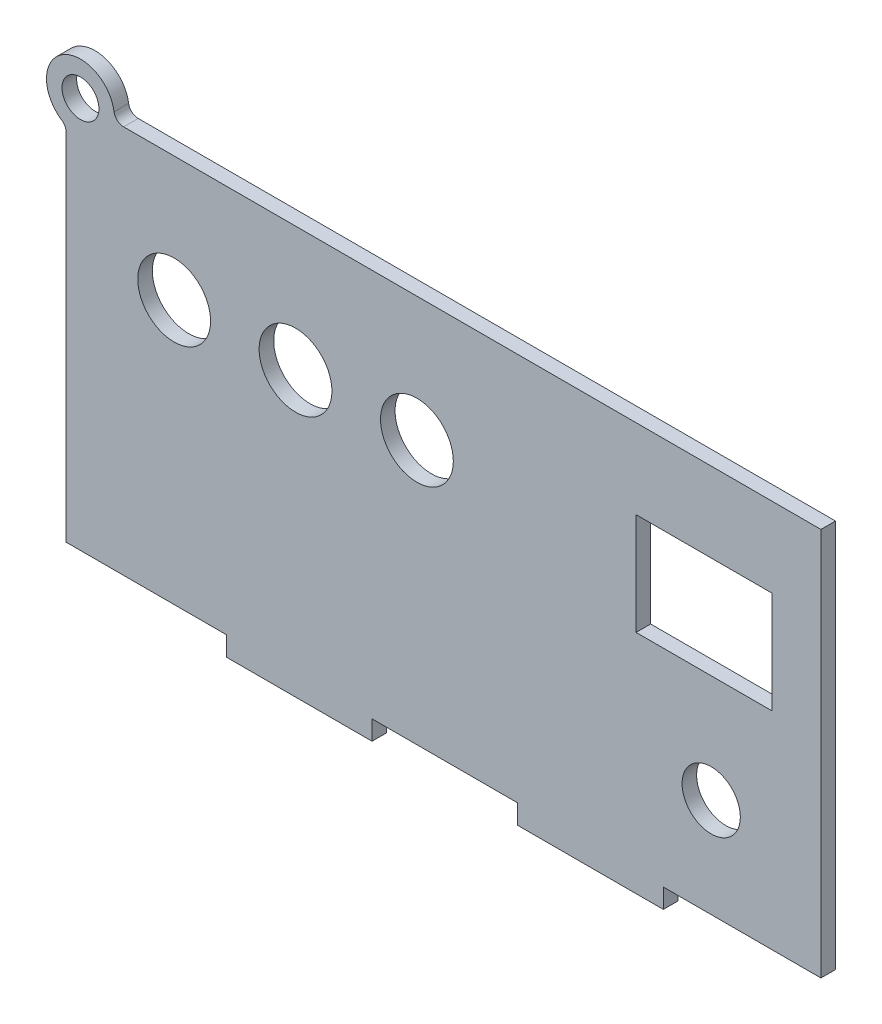
ISO-10303-21;
HEADER;
FILE_DESCRIPTION(('STEP AP214'),'2;1');
FILE_NAME('part.step','',(''),(''),'','','');
FILE_SCHEMA(('AUTOMOTIVE_DESIGN { 1 0 10303 214 1 1 1 1 }'));
ENDSEC;
DATA;
#1=APPLICATION_CONTEXT('core data for automotive mechanical design processes');
#2=APPLICATION_PROTOCOL_DEFINITION('international standard','automotive_design',2000,#1);
#3=PRODUCT_CONTEXT('',#1,'mechanical');
#4=PRODUCT('Part','Part','',(#3));
#5=PRODUCT_RELATED_PRODUCT_CATEGORY('part','',(#4));
#6=PRODUCT_DEFINITION_FORMATION('','',#4);
#7=PRODUCT_DEFINITION_CONTEXT('part definition',#1,'design');
#8=PRODUCT_DEFINITION('design','',#6,#7);
#9=PRODUCT_DEFINITION_SHAPE('','',#8);
#10=(LENGTH_UNIT() NAMED_UNIT(*) SI_UNIT(.MILLI.,.METRE.));
#11=(NAMED_UNIT(*) PLANE_ANGLE_UNIT() SI_UNIT($,.RADIAN.));
#12=(NAMED_UNIT(*) SI_UNIT($,.STERADIAN.) SOLID_ANGLE_UNIT());
#13=UNCERTAINTY_MEASURE_WITH_UNIT(LENGTH_MEASURE(1.E-05),#10,'distance_accuracy_value','');
#14=(GEOMETRIC_REPRESENTATION_CONTEXT(3) GLOBAL_UNCERTAINTY_ASSIGNED_CONTEXT((#13)) GLOBAL_UNIT_ASSIGNED_CONTEXT((#10,
#11,#12)) REPRESENTATION_CONTEXT('',''));
#15=CARTESIAN_POINT('',(0.,0.,0.));
#16=DIRECTION('',(0.,0.,1.));
#17=DIRECTION('',(1.,0.,0.));
#18=AXIS2_PLACEMENT_3D('',#15,#16,#17);
#19=CARTESIAN_POINT('',(-66.0593604878528,44.1837523820721,3.));
#20=DIRECTION('',(0.,0.,1.));
#21=DIRECTION('',(1.,0.,0.));
#22=AXIS2_PLACEMENT_3D('',#19,#20,#21);
#23=PLANE('',#22);
#24=CARTESIAN_POINT('',(-5.6639470731949,16.4892628720456,3.));
#25=DIRECTION('',(0.,0.,1.));
#26=DIRECTION('',(1.,0.,0.));
#27=AXIS2_PLACEMENT_3D('',#24,#25,#26);
#28=CIRCLE('',#27,7.5);
#29=CARTESIAN_POINT('',(1.8360529268051,16.4892628720456,3.));
#30=VERTEX_POINT('',#29);
#31=EDGE_CURVE('E623',#30,#30,#28,.T.);
#32=ORIENTED_EDGE('',*,*,#31,.F.);
#33=EDGE_LOOP('',(#32));
#34=FACE_BOUND('',#33,.T.);
#35=CARTESIAN_POINT('',(-55.6639470731949,16.4892628720456,3.));
#36=DIRECTION('',(0.,0.,1.));
#37=DIRECTION('',(1.,0.,0.));
#38=AXIS2_PLACEMENT_3D('',#35,#36,#37);
#39=CIRCLE('',#38,7.5);
#40=CARTESIAN_POINT('',(-48.1639470731949,16.4892628720456,3.));
#41=VERTEX_POINT('',#40);
#42=EDGE_CURVE('E192',#41,#41,#39,.T.);
#43=ORIENTED_EDGE('',*,*,#42,.F.);
#44=EDGE_LOOP('',(#43));
#45=FACE_BOUND('',#44,.T.);
#46=DIRECTION('',(-1.,0.,0.));
#47=VECTOR('',#46,1.);
#48=CARTESIAN_POINT('',(77.5537795455046,42.1837523820721,3.));
#49=LINE('',#48,#47);
#50=CARTESIAN_POINT('',(77.5537795455046,42.1837523820721,3.));
#51=VERTEX_POINT('',#50);
#52=CARTESIAN_POINT('',(-66.0593604878528,42.1837523820721,3.));
#53=VERTEX_POINT('',#52);
#54=EDGE_CURVE('E208',#51,#53,#49,.T.);
#55=ORIENTED_EDGE('',*,*,#54,.T.);
#56=CARTESIAN_POINT('',(-66.0593604878528,44.1837523820721,3.));
#57=DIRECTION('',(0.,0.,-1.));
#58=DIRECTION('',(1.,0.,0.));
#59=AXIS2_PLACEMENT_3D('',#56,#57,#58);
#60=CIRCLE('',#59,1.99999999999999);
#61=CARTESIAN_POINT('',(-68.0367324811814,43.883752382072,3.));
#62=VERTEX_POINT('',#61);
#63=EDGE_CURVE('E211',#53,#62,#60,.T.);
#64=ORIENTED_EDGE('',*,*,#63,.T.);
#65=CARTESIAN_POINT('',(-74.9575344578312,42.833752382072,3.));
#66=DIRECTION('',(0.,0.,1.));
#67=DIRECTION('',(1.,0.,0.));
#68=AXIS2_PLACEMENT_3D('',#65,#66,#67);
#69=CIRCLE('',#68,7.);
#70=CARTESIAN_POINT('',(-78.8075344578312,36.9875998011005,3.));
#71=VERTEX_POINT('',#70);
#72=EDGE_CURVE('E214',#62,#71,#69,.T.);
#73=ORIENTED_EDGE('',*,*,#72,.T.);
#74=CARTESIAN_POINT('',(-79.9075344578312,35.3172704922515,3.));
#75=DIRECTION('',(0.,0.,-1.));
#76=DIRECTION('',(-1.,0.,0.));
#77=AXIS2_PLACEMENT_3D('',#74,#75,#76);
#78=CIRCLE('',#77,2.);
#79=CARTESIAN_POINT('',(-77.9075344578312,35.3172704922515,3.));
#80=VERTEX_POINT('',#79);
#81=EDGE_CURVE('E216',#71,#80,#78,.T.);
#82=ORIENTED_EDGE('',*,*,#81,.T.);
#83=DIRECTION('',(0.,-1.,0.));
#84=VECTOR('',#83,1.);
#85=CARTESIAN_POINT('',(-77.9075344578312,-37.8310829635035,3.));
#86=LINE('',#85,#84);
#87=CARTESIAN_POINT('',(-77.9075344578312,-37.8310829635035,3.));
#88=VERTEX_POINT('',#87);
#89=EDGE_CURVE('E218',#80,#88,#86,.T.);
#90=ORIENTED_EDGE('',*,*,#89,.T.);
#91=DIRECTION('',(1.,0.,0.));
#92=VECTOR('',#91,1.);
#93=CARTESIAN_POINT('',(-77.9075344578312,-37.8310829635035,3.));
#94=LINE('',#93,#92);
#95=CARTESIAN_POINT('',(-44.9075344578312,-37.8310829635035,3.));
#96=VERTEX_POINT('',#95);
#97=EDGE_CURVE('E220',#88,#96,#94,.T.);
#98=ORIENTED_EDGE('',*,*,#97,.T.);
#99=DIRECTION('',(0.,-1.,0.));
#100=VECTOR('',#99,1.);
#101=CARTESIAN_POINT('',(-44.9075344578312,-41.8310829635035,3.));
#102=LINE('',#101,#100);
#103=CARTESIAN_POINT('',(-44.9075344578312,-41.8310829635035,3.));
#104=VERTEX_POINT('',#103);
#105=EDGE_CURVE('E222',#96,#104,#102,.T.);
#106=ORIENTED_EDGE('',*,*,#105,.T.);
#107=DIRECTION('',(1.,0.,0.));
#108=VECTOR('',#107,1.);
#109=CARTESIAN_POINT('',(-14.9075344578312,-41.8310829635035,3.));
#110=LINE('',#109,#108);
#111=CARTESIAN_POINT('',(-14.9075344578312,-41.8310829635035,3.));
#112=VERTEX_POINT('',#111);
#113=EDGE_CURVE('E224',#104,#112,#110,.T.);
#114=ORIENTED_EDGE('',*,*,#113,.T.);
#115=DIRECTION('',(0.,1.,0.));
#116=VECTOR('',#115,1.);
#117=CARTESIAN_POINT('',(-14.9075344578312,-41.8310829635035,3.));
#118=LINE('',#117,#116);
#119=CARTESIAN_POINT('',(-14.9075344578312,-37.8310829635035,3.));
#120=VERTEX_POINT('',#119);
#121=EDGE_CURVE('E226',#112,#120,#118,.T.);
#122=ORIENTED_EDGE('',*,*,#121,.T.);
#123=DIRECTION('',(1.,0.,0.));
#124=VECTOR('',#123,1.);
#125=CARTESIAN_POINT('',(-14.9075344578312,-37.8310829635035,3.));
#126=LINE('',#125,#124);
#127=CARTESIAN_POINT('',(15.0924655421688,-37.8310829635035,3.));
#128=VERTEX_POINT('',#127);
#129=EDGE_CURVE('E228',#120,#128,#126,.T.);
#130=ORIENTED_EDGE('',*,*,#129,.T.);
#131=DIRECTION('',(0.,-1.,0.));
#132=VECTOR('',#131,1.);
#133=CARTESIAN_POINT('',(15.0924655421688,-41.8310829635035,3.));
#134=LINE('',#133,#132);
#135=CARTESIAN_POINT('',(15.0924655421688,-41.8310829635035,3.));
#136=VERTEX_POINT('',#135);
#137=EDGE_CURVE('E230',#128,#136,#134,.T.);
#138=ORIENTED_EDGE('',*,*,#137,.T.);
#139=DIRECTION('',(1.,0.,0.));
#140=VECTOR('',#139,1.);
#141=CARTESIAN_POINT('',(45.0924655421688,-41.8310829635035,3.));
#142=LINE('',#141,#140);
#143=CARTESIAN_POINT('',(45.0924655421688,-41.8310829635035,3.));
#144=VERTEX_POINT('',#143);
#145=EDGE_CURVE('E232',#136,#144,#142,.T.);
#146=ORIENTED_EDGE('',*,*,#145,.T.);
#147=DIRECTION('',(0.,1.,0.));
#148=VECTOR('',#147,1.);
#149=CARTESIAN_POINT('',(45.0924655421688,-41.8310829635035,3.));
#150=LINE('',#149,#148);
#151=CARTESIAN_POINT('',(45.0924655421688,-37.8310829635035,3.));
#152=VERTEX_POINT('',#151);
#153=EDGE_CURVE('E234',#144,#152,#150,.T.);
#154=ORIENTED_EDGE('',*,*,#153,.T.);
#155=DIRECTION('',(1.,0.,0.));
#156=VECTOR('',#155,1.);
#157=CARTESIAN_POINT('',(45.0924655421688,-37.8310829635035,3.));
#158=LINE('',#157,#156);
#159=CARTESIAN_POINT('',(77.5537795455046,-37.8310829635035,3.));
#160=VERTEX_POINT('',#159);
#161=EDGE_CURVE('E236',#152,#160,#158,.T.);
#162=ORIENTED_EDGE('',*,*,#161,.T.);
#163=DIRECTION('',(0.,1.,0.));
#164=VECTOR('',#163,1.);
#165=CARTESIAN_POINT('',(77.5537795455046,-37.8310829635035,3.));
#166=LINE('',#165,#164);
#167=EDGE_CURVE('E238',#160,#51,#166,.T.);
#168=ORIENTED_EDGE('',*,*,#167,.T.);
#169=EDGE_LOOP('',(#55,#64,#73,#82,#90,#98,#106,#114,#122,#130,#138,#146,#154,#162,#168));
#170=FACE_BOUND('',#169,.T.);
#171=CARTESIAN_POINT('',(-74.9575344578312,42.833752382072,3.));
#172=DIRECTION('',(0.,0.,1.));
#173=DIRECTION('',(1.,0.,0.));
#174=AXIS2_PLACEMENT_3D('',#171,#172,#173);
#175=CIRCLE('',#174,3.8);
#176=CARTESIAN_POINT('',(-71.1575344578312,42.833752382072,3.));
#177=VERTEX_POINT('',#176);
#178=EDGE_CURVE('E202',#177,#177,#175,.T.);
#179=ORIENTED_EDGE('',*,*,#178,.F.);
#180=EDGE_LOOP('',(#179));
#181=FACE_BOUND('',#180,.T.);
#182=DIRECTION('',(1.,0.,0.));
#183=VECTOR('',#182,1.);
#184=CARTESIAN_POINT('',(67.4777739645771,4.77680387150185,3.));
#185=LINE('',#184,#183);
#186=CARTESIAN_POINT('',(39.4777739645771,4.77680387150185,3.));
#187=VERTEX_POINT('',#186);
#188=CARTESIAN_POINT('',(67.4777739645771,4.77680387150185,3.));
#189=VERTEX_POINT('',#188);
#190=EDGE_CURVE('E171',#187,#189,#185,.T.);
#191=ORIENTED_EDGE('',*,*,#190,.F.);
#192=DIRECTION('',(0.,-1.,0.));
#193=VECTOR('',#192,1.);
#194=CARTESIAN_POINT('',(39.4777739645771,4.77680387150185,3.));
#195=LINE('',#194,#193);
#196=CARTESIAN_POINT('',(39.4777739645771,25.7768038715019,3.));
#197=VERTEX_POINT('',#196);
#198=EDGE_CURVE('E163',#197,#187,#195,.T.);
#199=ORIENTED_EDGE('',*,*,#198,.F.);
#200=DIRECTION('',(-1.,0.,0.));
#201=VECTOR('',#200,1.);
#202=CARTESIAN_POINT('',(67.4777739645771,25.7768038715019,3.));
#203=LINE('',#202,#201);
#204=CARTESIAN_POINT('',(67.4777739645771,25.7768038715019,3.));
#205=VERTEX_POINT('',#204);
#206=EDGE_CURVE('E186',#205,#197,#203,.T.);
#207=ORIENTED_EDGE('',*,*,#206,.F.);
#208=DIRECTION('',(0.,1.,0.));
#209=VECTOR('',#208,1.);
#210=CARTESIAN_POINT('',(67.4777739645771,4.77680387150185,3.));
#211=LINE('',#210,#209);
#212=EDGE_CURVE('E184',#189,#205,#211,.T.);
#213=ORIENTED_EDGE('',*,*,#212,.F.);
#214=EDGE_LOOP('',(#191,#199,#207,#213));
#215=FACE_BOUND('',#214,.T.);
#216=CARTESIAN_POINT('',(-30.6639470731949,16.4892628720456,3.));
#217=DIRECTION('',(0.,0.,1.));
#218=DIRECTION('',(1.,0.,0.));
#219=AXIS2_PLACEMENT_3D('',#216,#217,#218);
#220=CIRCLE('',#219,7.5);
#221=CARTESIAN_POINT('',(-23.1639470731949,16.4892628720456,3.));
#222=VERTEX_POINT('',#221);
#223=EDGE_CURVE('E629',#222,#222,#220,.T.);
#224=ORIENTED_EDGE('',*,*,#223,.F.);
#225=EDGE_LOOP('',(#224));
#226=FACE_BOUND('',#225,.T.);
#227=CARTESIAN_POINT('',(54.9508765511538,-17.4407031301117,3.));
#228=DIRECTION('',(0.,0.,1.));
#229=DIRECTION('',(1.,0.,0.));
#230=AXIS2_PLACEMENT_3D('',#227,#228,#229);
#231=CIRCLE('',#230,6.);
#232=CARTESIAN_POINT('',(60.9508765511538,-17.4407031301117,3.));
#233=VERTEX_POINT('',#232);
#234=EDGE_CURVE('E614',#233,#233,#231,.T.);
#235=ORIENTED_EDGE('',*,*,#234,.F.);
#236=EDGE_LOOP('',(#235));
#237=FACE_BOUND('',#236,.T.);
#238=ADVANCED_FACE('F32',(#34,#45,#170,#181,#215,#226,#237),#23,.T.);
#239=CARTESIAN_POINT('',(-66.0593604878528,44.1837523820721,0.));
#240=DIRECTION('',(0.,0.,1.));
#241=DIRECTION('',(1.,0.,0.));
#242=AXIS2_PLACEMENT_3D('',#239,#240,#241);
#243=PLANE('',#242);
#244=CARTESIAN_POINT('',(-74.9575344578312,42.833752382072,0.));
#245=DIRECTION('',(0.,0.,1.));
#246=DIRECTION('',(1.,0.,0.));
#247=AXIS2_PLACEMENT_3D('',#244,#245,#246);
#248=CIRCLE('',#247,3.8);
#249=CARTESIAN_POINT('',(-71.1575344578312,42.833752382072,0.));
#250=VERTEX_POINT('',#249);
#251=EDGE_CURVE('E179',#250,#250,#248,.T.);
#252=ORIENTED_EDGE('',*,*,#251,.T.);
#253=EDGE_LOOP('',(#252));
#254=FACE_BOUND('',#253,.T.);
#255=DIRECTION('',(-1.,0.,0.));
#256=VECTOR('',#255,1.);
#257=CARTESIAN_POINT('',(77.5537795455046,42.1837523820721,0.));
#258=LINE('',#257,#256);
#259=CARTESIAN_POINT('',(77.5537795455046,42.1837523820721,0.));
#260=VERTEX_POINT('',#259);
#261=CARTESIAN_POINT('',(-66.0593604878528,42.1837523820721,0.));
#262=VERTEX_POINT('',#261);
#263=EDGE_CURVE('E205',#260,#262,#258,.T.);
#264=ORIENTED_EDGE('',*,*,#263,.F.);
#265=DIRECTION('',(0.,1.,0.));
#266=VECTOR('',#265,1.);
#267=CARTESIAN_POINT('',(77.5537795455046,-37.8310829635035,0.));
#268=LINE('',#267,#266);
#269=CARTESIAN_POINT('',(77.5537795455046,-37.8310829635035,0.));
#270=VERTEX_POINT('',#269);
#271=EDGE_CURVE('E212',#270,#260,#268,.T.);
#272=ORIENTED_EDGE('',*,*,#271,.F.);
#273=DIRECTION('',(1.,0.,0.));
#274=VECTOR('',#273,1.);
#275=CARTESIAN_POINT('',(45.0924655421688,-37.8310829635035,0.));
#276=LINE('',#275,#274);
#277=CARTESIAN_POINT('',(45.0924655421688,-37.8310829635035,0.));
#278=VERTEX_POINT('',#277);
#279=EDGE_CURVE('E268',#278,#270,#276,.T.);
#280=ORIENTED_EDGE('',*,*,#279,.F.);
#281=DIRECTION('',(0.,1.,0.));
#282=VECTOR('',#281,1.);
#283=CARTESIAN_POINT('',(45.0924655421688,-41.8310829635035,0.));
#284=LINE('',#283,#282);
#285=CARTESIAN_POINT('',(45.0924655421688,-41.8310829635035,0.));
#286=VERTEX_POINT('',#285);
#287=EDGE_CURVE('E266',#286,#278,#284,.T.);
#288=ORIENTED_EDGE('',*,*,#287,.F.);
#289=DIRECTION('',(1.,0.,0.));
#290=VECTOR('',#289,1.);
#291=CARTESIAN_POINT('',(45.0924655421688,-41.8310829635035,0.));
#292=LINE('',#291,#290);
#293=CARTESIAN_POINT('',(15.0924655421688,-41.8310829635035,0.));
#294=VERTEX_POINT('',#293);
#295=EDGE_CURVE('E264',#294,#286,#292,.T.);
#296=ORIENTED_EDGE('',*,*,#295,.F.);
#297=DIRECTION('',(0.,-1.,0.));
#298=VECTOR('',#297,1.);
#299=CARTESIAN_POINT('',(15.0924655421688,-41.8310829635035,0.));
#300=LINE('',#299,#298);
#301=CARTESIAN_POINT('',(15.0924655421688,-37.8310829635035,0.));
#302=VERTEX_POINT('',#301);
#303=EDGE_CURVE('E262',#302,#294,#300,.T.);
#304=ORIENTED_EDGE('',*,*,#303,.F.);
#305=DIRECTION('',(1.,0.,0.));
#306=VECTOR('',#305,1.);
#307=CARTESIAN_POINT('',(-14.9075344578312,-37.8310829635035,0.));
#308=LINE('',#307,#306);
#309=CARTESIAN_POINT('',(-14.9075344578312,-37.8310829635035,0.));
#310=VERTEX_POINT('',#309);
#311=EDGE_CURVE('E260',#310,#302,#308,.T.);
#312=ORIENTED_EDGE('',*,*,#311,.F.);
#313=DIRECTION('',(0.,1.,0.));
#314=VECTOR('',#313,1.);
#315=CARTESIAN_POINT('',(-14.9075344578312,-41.8310829635035,0.));
#316=LINE('',#315,#314);
#317=CARTESIAN_POINT('',(-14.9075344578312,-41.8310829635035,0.));
#318=VERTEX_POINT('',#317);
#319=EDGE_CURVE('E258',#318,#310,#316,.T.);
#320=ORIENTED_EDGE('',*,*,#319,.F.);
#321=DIRECTION('',(1.,0.,0.));
#322=VECTOR('',#321,1.);
#323=CARTESIAN_POINT('',(-14.9075344578312,-41.8310829635035,0.));
#324=LINE('',#323,#322);
#325=CARTESIAN_POINT('',(-44.9075344578312,-41.8310829635035,0.));
#326=VERTEX_POINT('',#325);
#327=EDGE_CURVE('E256',#326,#318,#324,.T.);
#328=ORIENTED_EDGE('',*,*,#327,.F.);
#329=DIRECTION('',(0.,-1.,0.));
#330=VECTOR('',#329,1.);
#331=CARTESIAN_POINT('',(-44.9075344578312,-41.8310829635035,0.));
#332=LINE('',#331,#330);
#333=CARTESIAN_POINT('',(-44.9075344578312,-37.8310829635035,0.));
#334=VERTEX_POINT('',#333);
#335=EDGE_CURVE('E254',#334,#326,#332,.T.);
#336=ORIENTED_EDGE('',*,*,#335,.F.);
#337=DIRECTION('',(1.,0.,0.));
#338=VECTOR('',#337,1.);
#339=CARTESIAN_POINT('',(-74.9075344578312,-37.8310829635035,0.));
#340=LINE('',#339,#338);
#341=CARTESIAN_POINT('',(-77.9075344578312,-37.8310829635035,0.));
#342=VERTEX_POINT('',#341);
#343=EDGE_CURVE('E252',#342,#334,#340,.T.);
#344=ORIENTED_EDGE('',*,*,#343,.F.);
#345=DIRECTION('',(0.,-1.,0.));
#346=VECTOR('',#345,1.);
#347=CARTESIAN_POINT('',(-77.9075344578312,-37.8310829635035,0.));
#348=LINE('',#347,#346);
#349=CARTESIAN_POINT('',(-77.9075344578312,35.3172704922515,0.));
#350=VERTEX_POINT('',#349);
#351=EDGE_CURVE('E249',#350,#342,#348,.T.);
#352=ORIENTED_EDGE('',*,*,#351,.F.);
#353=CARTESIAN_POINT('',(-79.9075344578312,35.3172704922515,0.));
#354=DIRECTION('',(0.,0.,-1.));
#355=DIRECTION('',(-1.,0.,0.));
#356=AXIS2_PLACEMENT_3D('',#353,#354,#355);
#357=CIRCLE('',#356,2.);
#358=CARTESIAN_POINT('',(-78.8075344578312,36.9875998011005,0.));
#359=VERTEX_POINT('',#358);
#360=EDGE_CURVE('E247',#359,#350,#357,.T.);
#361=ORIENTED_EDGE('',*,*,#360,.F.);
#362=CARTESIAN_POINT('',(-74.9575344578312,42.833752382072,0.));
#363=DIRECTION('',(0.,0.,1.));
#364=DIRECTION('',(1.,0.,0.));
#365=AXIS2_PLACEMENT_3D('',#362,#363,#364);
#366=CIRCLE('',#365,7.);
#367=CARTESIAN_POINT('',(-68.0367324811814,43.883752382072,0.));
#368=VERTEX_POINT('',#367);
#369=EDGE_CURVE('E245',#368,#359,#366,.T.);
#370=ORIENTED_EDGE('',*,*,#369,.F.);
#371=CARTESIAN_POINT('',(-66.0593604878528,44.1837523820721,0.));
#372=DIRECTION('',(0.,0.,-1.));
#373=DIRECTION('',(1.,0.,0.));
#374=AXIS2_PLACEMENT_3D('',#371,#372,#373);
#375=CIRCLE('',#374,1.99999999999999);
#376=EDGE_CURVE('E243',#262,#368,#375,.T.);
#377=ORIENTED_EDGE('',*,*,#376,.F.);
#378=EDGE_LOOP('',(#264,#272,#280,#288,#296,#304,#312,#320,#328,#336,#344,#352,#361,#370,#377));
#379=FACE_BOUND('',#378,.T.);
#380=DIRECTION('',(0.,-1.,0.));
#381=VECTOR('',#380,1.);
#382=CARTESIAN_POINT('',(39.4777739645771,4.77680387150185,0.));
#383=LINE('',#382,#381);
#384=CARTESIAN_POINT('',(39.4777739645771,25.7768038715019,0.));
#385=VERTEX_POINT('',#384);
#386=CARTESIAN_POINT('',(39.4777739645771,4.77680387150185,0.));
#387=VERTEX_POINT('',#386);
#388=EDGE_CURVE('E55',#385,#387,#383,.T.);
#389=ORIENTED_EDGE('',*,*,#388,.T.);
#390=DIRECTION('',(1.,0.,0.));
#391=VECTOR('',#390,1.);
#392=CARTESIAN_POINT('',(67.4777739645771,4.77680387150185,0.));
#393=LINE('',#392,#391);
#394=CARTESIAN_POINT('',(67.4777739645771,4.77680387150185,0.));
#395=VERTEX_POINT('',#394);
#396=EDGE_CURVE('E178',#387,#395,#393,.T.);
#397=ORIENTED_EDGE('',*,*,#396,.T.);
#398=DIRECTION('',(0.,1.,0.));
#399=VECTOR('',#398,1.);
#400=CARTESIAN_POINT('',(67.4777739645771,4.77680387150185,0.));
#401=LINE('',#400,#399);
#402=CARTESIAN_POINT('',(67.4777739645771,25.7768038715019,0.));
#403=VERTEX_POINT('',#402);
#404=EDGE_CURVE('E194',#395,#403,#401,.T.);
#405=ORIENTED_EDGE('',*,*,#404,.T.);
#406=DIRECTION('',(-1.,0.,0.));
#407=VECTOR('',#406,1.);
#408=CARTESIAN_POINT('',(67.4777739645771,25.7768038715019,0.));
#409=LINE('',#408,#407);
#410=EDGE_CURVE('E172',#403,#385,#409,.T.);
#411=ORIENTED_EDGE('',*,*,#410,.T.);
#412=EDGE_LOOP('',(#389,#397,#405,#411));
#413=FACE_BOUND('',#412,.T.);
#414=CARTESIAN_POINT('',(-55.6639470731949,16.4892628720456,0.));
#415=DIRECTION('',(0.,0.,1.));
#416=DIRECTION('',(1.,0.,0.));
#417=AXIS2_PLACEMENT_3D('',#414,#415,#416);
#418=CIRCLE('',#417,7.5);
#419=CARTESIAN_POINT('',(-48.1639470731949,16.4892628720456,0.));
#420=VERTEX_POINT('',#419);
#421=EDGE_CURVE('E632',#420,#420,#418,.T.);
#422=ORIENTED_EDGE('',*,*,#421,.T.);
#423=EDGE_LOOP('',(#422));
#424=FACE_BOUND('',#423,.T.);
#425=CARTESIAN_POINT('',(-30.6639470731949,16.4892628720456,0.));
#426=DIRECTION('',(0.,0.,1.));
#427=DIRECTION('',(1.,0.,0.));
#428=AXIS2_PLACEMENT_3D('',#425,#426,#427);
#429=CIRCLE('',#428,7.5);
#430=CARTESIAN_POINT('',(-23.1639470731949,16.4892628720456,0.));
#431=VERTEX_POINT('',#430);
#432=EDGE_CURVE('E626',#431,#431,#429,.T.);
#433=ORIENTED_EDGE('',*,*,#432,.T.);
#434=EDGE_LOOP('',(#433));
#435=FACE_BOUND('',#434,.T.);
#436=CARTESIAN_POINT('',(-5.6639470731949,16.4892628720456,0.));
#437=DIRECTION('',(0.,0.,1.));
#438=DIRECTION('',(1.,0.,0.));
#439=AXIS2_PLACEMENT_3D('',#436,#437,#438);
#440=CIRCLE('',#439,7.5);
#441=CARTESIAN_POINT('',(1.8360529268051,16.4892628720456,0.));
#442=VERTEX_POINT('',#441);
#443=EDGE_CURVE('E620',#442,#442,#440,.T.);
#444=ORIENTED_EDGE('',*,*,#443,.T.);
#445=EDGE_LOOP('',(#444));
#446=FACE_BOUND('',#445,.T.);
#447=CARTESIAN_POINT('',(54.9508765511538,-17.4407031301117,0.));
#448=DIRECTION('',(0.,0.,1.));
#449=DIRECTION('',(1.,0.,0.));
#450=AXIS2_PLACEMENT_3D('',#447,#448,#449);
#451=CIRCLE('',#450,6.);
#452=CARTESIAN_POINT('',(60.9508765511538,-17.4407031301117,0.));
#453=VERTEX_POINT('',#452);
#454=EDGE_CURVE('E617',#453,#453,#451,.T.);
#455=ORIENTED_EDGE('',*,*,#454,.T.);
#456=EDGE_LOOP('',(#455));
#457=FACE_BOUND('',#456,.T.);
#458=ADVANCED_FACE('F319',(#254,#379,#413,#424,#435,#446,#457),#243,.F.);
#459=CARTESIAN_POINT('',(77.5537795455046,42.1837523820721,3.));
#460=DIRECTION('',(0.,-1.,0.));
#461=DIRECTION('',(0.,0.,-1.));
#462=AXIS2_PLACEMENT_3D('',#459,#460,#461);
#463=PLANE('',#462);
#464=ORIENTED_EDGE('',*,*,#263,.T.);
#465=DIRECTION('',(0.,0.,-1.));
#466=VECTOR('',#465,1.);
#467=CARTESIAN_POINT('',(-66.0593604878528,42.1837523820721,3.));
#468=LINE('',#467,#466);
#469=EDGE_CURVE('E11',#53,#262,#468,.T.);
#470=ORIENTED_EDGE('',*,*,#469,.F.);
#471=ORIENTED_EDGE('',*,*,#54,.F.);
#472=DIRECTION('',(0.,0.,-1.));
#473=VECTOR('',#472,1.);
#474=CARTESIAN_POINT('',(77.5537795455046,42.1837523820721,3.));
#475=LINE('',#474,#473);
#476=EDGE_CURVE('E240',#51,#260,#475,.T.);
#477=ORIENTED_EDGE('',*,*,#476,.T.);
#478=EDGE_LOOP('',(#464,#470,#471,#477));
#479=FACE_BOUND('',#478,.T.);
#480=ADVANCED_FACE('F34',(#479),#463,.F.);
#481=CARTESIAN_POINT('',(-66.0593604878528,44.1837523820721,3.));
#482=DIRECTION('',(0.,0.,-1.));
#483=DIRECTION('',(-1.,0.,0.));
#484=AXIS2_PLACEMENT_3D('',#481,#482,#483);
#485=CYLINDRICAL_SURFACE('',#484,1.99999999999999);
#486=ORIENTED_EDGE('',*,*,#376,.T.);
#487=DIRECTION('',(0.,0.,-1.));
#488=VECTOR('',#487,1.);
#489=CARTESIAN_POINT('',(-68.0367324811814,43.883752382072,3.));
#490=LINE('',#489,#488);
#491=EDGE_CURVE('E40',#62,#368,#490,.T.);
#492=ORIENTED_EDGE('',*,*,#491,.F.);
#493=ORIENTED_EDGE('',*,*,#63,.F.);
#494=ORIENTED_EDGE('',*,*,#469,.T.);
#495=EDGE_LOOP('',(#486,#492,#493,#494));
#496=FACE_BOUND('',#495,.T.);
#497=ADVANCED_FACE('F336',(#496),#485,.F.);
#498=CARTESIAN_POINT('',(-74.9575344578312,42.833752382072,3.));
#499=DIRECTION('',(0.,0.,-1.));
#500=DIRECTION('',(-1.,0.,0.));
#501=AXIS2_PLACEMENT_3D('',#498,#499,#500);
#502=CYLINDRICAL_SURFACE('',#501,7.);
#503=ORIENTED_EDGE('',*,*,#369,.T.);
#504=DIRECTION('',(0.,0.,-1.));
#505=VECTOR('',#504,1.);
#506=CARTESIAN_POINT('',(-78.8075344578312,36.9875998011005,3.));
#507=LINE('',#506,#505);
#508=EDGE_CURVE('E306',#71,#359,#507,.T.);
#509=ORIENTED_EDGE('',*,*,#508,.F.);
#510=ORIENTED_EDGE('',*,*,#72,.F.);
#511=ORIENTED_EDGE('',*,*,#491,.T.);
#512=EDGE_LOOP('',(#503,#509,#510,#511));
#513=FACE_BOUND('',#512,.T.);
#514=ADVANCED_FACE('F313',(#513),#502,.T.);
#515=CARTESIAN_POINT('',(-79.9075344578312,35.3172704922515,3.));
#516=DIRECTION('',(0.,0.,-1.));
#517=DIRECTION('',(-1.,0.,0.));
#518=AXIS2_PLACEMENT_3D('',#515,#516,#517);
#519=CYLINDRICAL_SURFACE('',#518,2.);
#520=ORIENTED_EDGE('',*,*,#360,.T.);
#521=DIRECTION('',(0.,0.,-1.));
#522=VECTOR('',#521,1.);
#523=CARTESIAN_POINT('',(-77.9075344578312,35.3172704922515,3.));
#524=LINE('',#523,#522);
#525=EDGE_CURVE('E303',#80,#350,#524,.T.);
#526=ORIENTED_EDGE('',*,*,#525,.F.);
#527=ORIENTED_EDGE('',*,*,#81,.F.);
#528=ORIENTED_EDGE('',*,*,#508,.T.);
#529=EDGE_LOOP('',(#520,#526,#527,#528));
#530=FACE_BOUND('',#529,.T.);
#531=ADVANCED_FACE('F324',(#530),#519,.F.);
#532=CARTESIAN_POINT('',(-77.9075344578312,-37.8310829635035,3.));
#533=DIRECTION('',(1.,0.,0.));
#534=DIRECTION('',(0.,0.,-1.));
#535=AXIS2_PLACEMENT_3D('',#532,#533,#534);
#536=PLANE('',#535);
#537=ORIENTED_EDGE('',*,*,#351,.T.);
#538=DIRECTION('',(0.,0.,-1.));
#539=VECTOR('',#538,1.);
#540=CARTESIAN_POINT('',(-77.9075344578312,-37.8310829635035,3.));
#541=LINE('',#540,#539);
#542=EDGE_CURVE('E300',#88,#342,#541,.T.);
#543=ORIENTED_EDGE('',*,*,#542,.F.);
#544=ORIENTED_EDGE('',*,*,#89,.F.);
#545=ORIENTED_EDGE('',*,*,#525,.T.);
#546=EDGE_LOOP('',(#537,#543,#544,#545));
#547=FACE_BOUND('',#546,.T.);
#548=ADVANCED_FACE('F328',(#547),#536,.F.);
#549=CARTESIAN_POINT('',(-74.9075344578312,-37.8310829635035,3.));
#550=DIRECTION('',(0.,1.,0.));
#551=DIRECTION('',(0.,0.,1.));
#552=AXIS2_PLACEMENT_3D('',#549,#550,#551);
#553=PLANE('',#552);
#554=ORIENTED_EDGE('',*,*,#343,.T.);
#555=DIRECTION('',(0.,0.,-1.));
#556=VECTOR('',#555,1.);
#557=CARTESIAN_POINT('',(-44.9075344578312,-37.8310829635035,3.));
#558=LINE('',#557,#556);
#559=EDGE_CURVE('E297',#96,#334,#558,.T.);
#560=ORIENTED_EDGE('',*,*,#559,.F.);
#561=ORIENTED_EDGE('',*,*,#97,.F.);
#562=ORIENTED_EDGE('',*,*,#542,.T.);
#563=EDGE_LOOP('',(#554,#560,#561,#562));
#564=FACE_BOUND('',#563,.T.);
#565=ADVANCED_FACE('F384',(#564),#553,.F.);
#566=CARTESIAN_POINT('',(-44.9075344578312,-41.8310829635035,3.));
#567=DIRECTION('',(1.,0.,0.));
#568=DIRECTION('',(0.,0.,-1.));
#569=AXIS2_PLACEMENT_3D('',#566,#567,#568);
#570=PLANE('',#569);
#571=ORIENTED_EDGE('',*,*,#335,.T.);
#572=DIRECTION('',(0.,0.,-1.));
#573=VECTOR('',#572,1.);
#574=CARTESIAN_POINT('',(-44.9075344578312,-41.8310829635035,3.));
#575=LINE('',#574,#573);
#576=EDGE_CURVE('E294',#104,#326,#575,.T.);
#577=ORIENTED_EDGE('',*,*,#576,.F.);
#578=ORIENTED_EDGE('',*,*,#105,.F.);
#579=ORIENTED_EDGE('',*,*,#559,.T.);
#580=EDGE_LOOP('',(#571,#577,#578,#579));
#581=FACE_BOUND('',#580,.T.);
#582=ADVANCED_FACE('F382',(#581),#570,.F.);
#583=CARTESIAN_POINT('',(-14.9075344578312,-41.8310829635035,3.));
#584=DIRECTION('',(0.,1.,0.));
#585=DIRECTION('',(0.,0.,1.));
#586=AXIS2_PLACEMENT_3D('',#583,#584,#585);
#587=PLANE('',#586);
#588=ORIENTED_EDGE('',*,*,#327,.T.);
#589=DIRECTION('',(0.,0.,-1.));
#590=VECTOR('',#589,1.);
#591=CARTESIAN_POINT('',(-14.9075344578312,-41.8310829635035,3.));
#592=LINE('',#591,#590);
#593=EDGE_CURVE('E291',#112,#318,#592,.T.);
#594=ORIENTED_EDGE('',*,*,#593,.F.);
#595=ORIENTED_EDGE('',*,*,#113,.F.);
#596=ORIENTED_EDGE('',*,*,#576,.T.);
#597=EDGE_LOOP('',(#588,#594,#595,#596));
#598=FACE_BOUND('',#597,.T.);
#599=ADVANCED_FACE('F378',(#598),#587,.F.);
#600=CARTESIAN_POINT('',(-14.9075344578312,-41.8310829635035,3.));
#601=DIRECTION('',(-1.,0.,0.));
#602=DIRECTION('',(0.,0.,1.));
#603=AXIS2_PLACEMENT_3D('',#600,#601,#602);
#604=PLANE('',#603);
#605=ORIENTED_EDGE('',*,*,#319,.T.);
#606=DIRECTION('',(0.,0.,-1.));
#607=VECTOR('',#606,1.);
#608=CARTESIAN_POINT('',(-14.9075344578312,-37.8310829635035,3.));
#609=LINE('',#608,#607);
#610=EDGE_CURVE('E288',#120,#310,#609,.T.);
#611=ORIENTED_EDGE('',*,*,#610,.F.);
#612=ORIENTED_EDGE('',*,*,#121,.F.);
#613=ORIENTED_EDGE('',*,*,#593,.T.);
#614=EDGE_LOOP('',(#605,#611,#612,#613));
#615=FACE_BOUND('',#614,.T.);
#616=ADVANCED_FACE('F373',(#615),#604,.F.);
#617=CARTESIAN_POINT('',(-14.9075344578312,-37.8310829635035,3.));
#618=DIRECTION('',(0.,1.,0.));
#619=DIRECTION('',(0.,0.,1.));
#620=AXIS2_PLACEMENT_3D('',#617,#618,#619);
#621=PLANE('',#620);
#622=ORIENTED_EDGE('',*,*,#311,.T.);
#623=DIRECTION('',(0.,0.,-1.));
#624=VECTOR('',#623,1.);
#625=CARTESIAN_POINT('',(15.0924655421688,-37.8310829635035,3.));
#626=LINE('',#625,#624);
#627=EDGE_CURVE('E285',#128,#302,#626,.T.);
#628=ORIENTED_EDGE('',*,*,#627,.F.);
#629=ORIENTED_EDGE('',*,*,#129,.F.);
#630=ORIENTED_EDGE('',*,*,#610,.T.);
#631=EDGE_LOOP('',(#622,#628,#629,#630));
#632=FACE_BOUND('',#631,.T.);
#633=ADVANCED_FACE('F367',(#632),#621,.F.);
#634=CARTESIAN_POINT('',(15.0924655421688,-41.8310829635035,3.));
#635=DIRECTION('',(1.,0.,0.));
#636=DIRECTION('',(0.,0.,-1.));
#637=AXIS2_PLACEMENT_3D('',#634,#635,#636);
#638=PLANE('',#637);
#639=ORIENTED_EDGE('',*,*,#303,.T.);
#640=DIRECTION('',(0.,0.,-1.));
#641=VECTOR('',#640,1.);
#642=CARTESIAN_POINT('',(15.0924655421688,-41.8310829635035,3.));
#643=LINE('',#642,#641);
#644=EDGE_CURVE('E282',#136,#294,#643,.T.);
#645=ORIENTED_EDGE('',*,*,#644,.F.);
#646=ORIENTED_EDGE('',*,*,#137,.F.);
#647=ORIENTED_EDGE('',*,*,#627,.T.);
#648=EDGE_LOOP('',(#639,#645,#646,#647));
#649=FACE_BOUND('',#648,.T.);
#650=ADVANCED_FACE('F363',(#649),#638,.F.);
#651=CARTESIAN_POINT('',(45.0924655421688,-41.8310829635035,3.));
#652=DIRECTION('',(0.,1.,0.));
#653=DIRECTION('',(0.,0.,1.));
#654=AXIS2_PLACEMENT_3D('',#651,#652,#653);
#655=PLANE('',#654);
#656=ORIENTED_EDGE('',*,*,#295,.T.);
#657=DIRECTION('',(0.,0.,-1.));
#658=VECTOR('',#657,1.);
#659=CARTESIAN_POINT('',(45.0924655421688,-41.8310829635035,3.));
#660=LINE('',#659,#658);
#661=EDGE_CURVE('E279',#144,#286,#660,.T.);
#662=ORIENTED_EDGE('',*,*,#661,.F.);
#663=ORIENTED_EDGE('',*,*,#145,.F.);
#664=ORIENTED_EDGE('',*,*,#644,.T.);
#665=EDGE_LOOP('',(#656,#662,#663,#664));
#666=FACE_BOUND('',#665,.T.);
#667=ADVANCED_FACE('F358',(#666),#655,.F.);
#668=CARTESIAN_POINT('',(45.0924655421688,-41.8310829635035,3.));
#669=DIRECTION('',(-1.,0.,0.));
#670=DIRECTION('',(0.,0.,1.));
#671=AXIS2_PLACEMENT_3D('',#668,#669,#670);
#672=PLANE('',#671);
#673=ORIENTED_EDGE('',*,*,#287,.T.);
#674=DIRECTION('',(0.,0.,-1.));
#675=VECTOR('',#674,1.);
#676=CARTESIAN_POINT('',(45.0924655421688,-37.8310829635035,3.));
#677=LINE('',#676,#675);
#678=EDGE_CURVE('E276',#152,#278,#677,.T.);
#679=ORIENTED_EDGE('',*,*,#678,.F.);
#680=ORIENTED_EDGE('',*,*,#153,.F.);
#681=ORIENTED_EDGE('',*,*,#661,.T.);
#682=EDGE_LOOP('',(#673,#679,#680,#681));
#683=FACE_BOUND('',#682,.T.);
#684=ADVANCED_FACE('F352',(#683),#672,.F.);
#685=CARTESIAN_POINT('',(45.0924655421688,-37.8310829635035,3.));
#686=DIRECTION('',(0.,1.,0.));
#687=DIRECTION('',(0.,0.,1.));
#688=AXIS2_PLACEMENT_3D('',#685,#686,#687);
#689=PLANE('',#688);
#690=ORIENTED_EDGE('',*,*,#279,.T.);
#691=DIRECTION('',(0.,0.,-1.));
#692=VECTOR('',#691,1.);
#693=CARTESIAN_POINT('',(77.5537795455046,-37.8310829635035,3.));
#694=LINE('',#693,#692);
#695=EDGE_CURVE('E273',#160,#270,#694,.T.);
#696=ORIENTED_EDGE('',*,*,#695,.F.);
#697=ORIENTED_EDGE('',*,*,#161,.F.);
#698=ORIENTED_EDGE('',*,*,#678,.T.);
#699=EDGE_LOOP('',(#690,#696,#697,#698));
#700=FACE_BOUND('',#699,.T.);
#701=ADVANCED_FACE('F348',(#700),#689,.F.);
#702=CARTESIAN_POINT('',(77.5537795455046,-37.8310829635035,3.));
#703=DIRECTION('',(-1.,0.,0.));
#704=DIRECTION('',(0.,-1.,0.));
#705=AXIS2_PLACEMENT_3D('',#702,#703,#704);
#706=PLANE('',#705);
#707=ORIENTED_EDGE('',*,*,#271,.T.);
#708=ORIENTED_EDGE('',*,*,#476,.F.);
#709=ORIENTED_EDGE('',*,*,#167,.F.);
#710=ORIENTED_EDGE('',*,*,#695,.T.);
#711=EDGE_LOOP('',(#707,#708,#709,#710));
#712=FACE_BOUND('',#711,.T.);
#713=ADVANCED_FACE('F343',(#712),#706,.F.);
#714=CARTESIAN_POINT('',(-74.9575344578312,42.833752382072,3.));
#715=DIRECTION('',(0.,0.,-1.));
#716=DIRECTION('',(-1.,0.,0.));
#717=AXIS2_PLACEMENT_3D('',#714,#715,#716);
#718=CYLINDRICAL_SURFACE('',#717,3.8);
#719=ORIENTED_EDGE('',*,*,#178,.T.);
#720=EDGE_LOOP('',(#719));
#721=FACE_BOUND('',#720,.T.);
#722=ORIENTED_EDGE('',*,*,#251,.F.);
#723=EDGE_LOOP('',(#722));
#724=FACE_BOUND('',#723,.T.);
#725=ADVANCED_FACE('F404',(#721,#724),#718,.F.);
#726=CARTESIAN_POINT('',(39.4777739645771,4.77680387150185,3.));
#727=DIRECTION('',(1.,0.,0.));
#728=DIRECTION('',(0.,0.,-1.));
#729=AXIS2_PLACEMENT_3D('',#726,#727,#728);
#730=PLANE('',#729);
#731=ORIENTED_EDGE('',*,*,#388,.F.);
#732=DIRECTION('',(0.,0.,-1.));
#733=VECTOR('',#732,1.);
#734=CARTESIAN_POINT('',(39.4777739645771,25.7768038715019,3.));
#735=LINE('',#734,#733);
#736=EDGE_CURVE('E167',#197,#385,#735,.T.);
#737=ORIENTED_EDGE('',*,*,#736,.F.);
#738=ORIENTED_EDGE('',*,*,#198,.T.);
#739=DIRECTION('',(0.,0.,-1.));
#740=VECTOR('',#739,1.);
#741=CARTESIAN_POINT('',(39.4777739645771,4.77680387150185,3.));
#742=LINE('',#741,#740);
#743=EDGE_CURVE('E166',#187,#387,#742,.T.);
#744=ORIENTED_EDGE('',*,*,#743,.T.);
#745=EDGE_LOOP('',(#731,#737,#738,#744));
#746=FACE_BOUND('',#745,.T.);
#747=ADVANCED_FACE('F165',(#746),#730,.T.);
#748=CARTESIAN_POINT('',(67.4777739645771,4.77680387150185,3.));
#749=DIRECTION('',(0.,1.,0.));
#750=DIRECTION('',(0.,0.,1.));
#751=AXIS2_PLACEMENT_3D('',#748,#749,#750);
#752=PLANE('',#751);
#753=ORIENTED_EDGE('',*,*,#396,.F.);
#754=ORIENTED_EDGE('',*,*,#743,.F.);
#755=ORIENTED_EDGE('',*,*,#190,.T.);
#756=DIRECTION('',(0.,0.,-1.));
#757=VECTOR('',#756,1.);
#758=CARTESIAN_POINT('',(67.4777739645771,4.77680387150185,3.));
#759=LINE('',#758,#757);
#760=EDGE_CURVE('E180',#189,#395,#759,.T.);
#761=ORIENTED_EDGE('',*,*,#760,.T.);
#762=EDGE_LOOP('',(#753,#754,#755,#761));
#763=FACE_BOUND('',#762,.T.);
#764=ADVANCED_FACE('F175',(#763),#752,.T.);
#765=CARTESIAN_POINT('',(67.4777739645771,4.77680387150185,3.));
#766=DIRECTION('',(-1.,0.,0.));
#767=DIRECTION('',(0.,0.,1.));
#768=AXIS2_PLACEMENT_3D('',#765,#766,#767);
#769=PLANE('',#768);
#770=ORIENTED_EDGE('',*,*,#404,.F.);
#771=ORIENTED_EDGE('',*,*,#760,.F.);
#772=ORIENTED_EDGE('',*,*,#212,.T.);
#773=DIRECTION('',(0.,0.,-1.));
#774=VECTOR('',#773,1.);
#775=CARTESIAN_POINT('',(67.4777739645771,25.7768038715019,3.));
#776=LINE('',#775,#774);
#777=EDGE_CURVE('E47',#205,#403,#776,.T.);
#778=ORIENTED_EDGE('',*,*,#777,.T.);
#779=EDGE_LOOP('',(#770,#771,#772,#778));
#780=FACE_BOUND('',#779,.T.);
#781=ADVANCED_FACE('F471',(#780),#769,.T.);
#782=CARTESIAN_POINT('',(67.4777739645771,25.7768038715019,3.));
#783=DIRECTION('',(0.,-1.,0.));
#784=DIRECTION('',(1.,0.,0.));
#785=AXIS2_PLACEMENT_3D('',#782,#783,#784);
#786=PLANE('',#785);
#787=ORIENTED_EDGE('',*,*,#410,.F.);
#788=ORIENTED_EDGE('',*,*,#777,.F.);
#789=ORIENTED_EDGE('',*,*,#206,.T.);
#790=ORIENTED_EDGE('',*,*,#736,.T.);
#791=EDGE_LOOP('',(#787,#788,#789,#790));
#792=FACE_BOUND('',#791,.T.);
#793=ADVANCED_FACE('F478',(#792),#786,.T.);
#794=CARTESIAN_POINT('',(-55.6639470731949,16.4892628720456,3.));
#795=DIRECTION('',(0.,0.,-1.));
#796=DIRECTION('',(-1.,0.,0.));
#797=AXIS2_PLACEMENT_3D('',#794,#795,#796);
#798=CYLINDRICAL_SURFACE('',#797,7.5);
#799=ORIENTED_EDGE('',*,*,#42,.T.);
#800=EDGE_LOOP('',(#799));
#801=FACE_BOUND('',#800,.T.);
#802=ORIENTED_EDGE('',*,*,#421,.F.);
#803=EDGE_LOOP('',(#802));
#804=FACE_BOUND('',#803,.T.);
#805=ADVANCED_FACE('F486',(#801,#804),#798,.F.);
#806=CARTESIAN_POINT('',(-30.6639470731949,16.4892628720456,3.));
#807=DIRECTION('',(0.,0.,-1.));
#808=DIRECTION('',(-1.,0.,0.));
#809=AXIS2_PLACEMENT_3D('',#806,#807,#808);
#810=CYLINDRICAL_SURFACE('',#809,7.5);
#811=ORIENTED_EDGE('',*,*,#223,.T.);
#812=EDGE_LOOP('',(#811));
#813=FACE_BOUND('',#812,.T.);
#814=ORIENTED_EDGE('',*,*,#432,.F.);
#815=EDGE_LOOP('',(#814));
#816=FACE_BOUND('',#815,.T.);
#817=ADVANCED_FACE('F493',(#813,#816),#810,.F.);
#818=CARTESIAN_POINT('',(-5.6639470731949,16.4892628720456,3.));
#819=DIRECTION('',(0.,0.,-1.));
#820=DIRECTION('',(-1.,0.,0.));
#821=AXIS2_PLACEMENT_3D('',#818,#819,#820);
#822=CYLINDRICAL_SURFACE('',#821,7.5);
#823=ORIENTED_EDGE('',*,*,#31,.T.);
#824=EDGE_LOOP('',(#823));
#825=FACE_BOUND('',#824,.T.);
#826=ORIENTED_EDGE('',*,*,#443,.F.);
#827=EDGE_LOOP('',(#826));
#828=FACE_BOUND('',#827,.T.);
#829=ADVANCED_FACE('F501',(#825,#828),#822,.F.);
#830=CARTESIAN_POINT('',(54.9508765511538,-17.4407031301117,3.));
#831=DIRECTION('',(0.,0.,-1.));
#832=DIRECTION('',(-1.,0.,0.));
#833=AXIS2_PLACEMENT_3D('',#830,#831,#832);
#834=CYLINDRICAL_SURFACE('',#833,6.);
#835=ORIENTED_EDGE('',*,*,#234,.T.);
#836=EDGE_LOOP('',(#835));
#837=FACE_BOUND('',#836,.T.);
#838=ORIENTED_EDGE('',*,*,#454,.F.);
#839=EDGE_LOOP('',(#838));
#840=FACE_BOUND('',#839,.T.);
#841=ADVANCED_FACE('F509',(#837,#840),#834,.F.);
#842=CLOSED_SHELL('',(#238,#458,#480,#497,#514,#531,#548,#565,#582,#599,#616,#633,#650,#667,
#684,#701,#713,#725,#747,#764,#781,#793,#805,#817,#829,#841));
#843=MANIFOLD_SOLID_BREP('B2',#842);
#844=ADVANCED_BREP_SHAPE_REPRESENTATION('',(#18,#843),#14);
#845=SHAPE_DEFINITION_REPRESENTATION(#9,#844);
ENDSEC;
END-ISO-10303-21;
